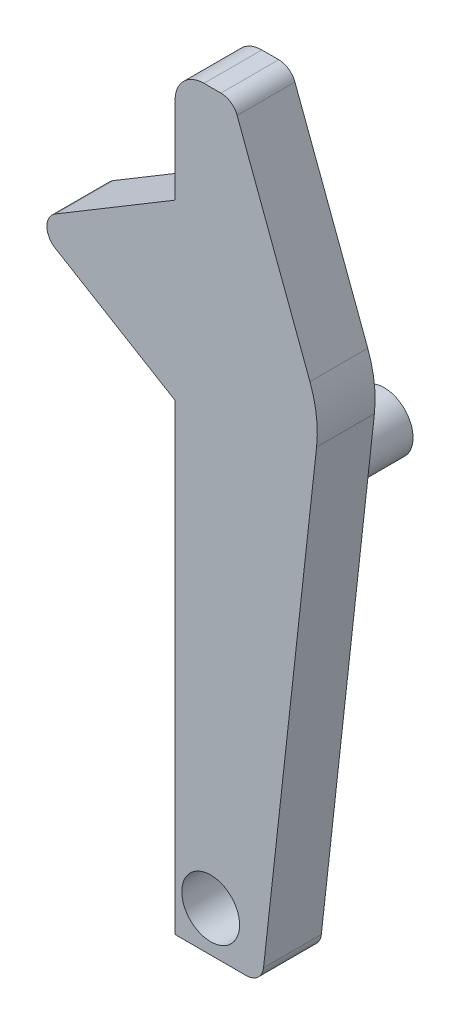
ISO-10303-21;
HEADER;
FILE_DESCRIPTION(('STEP AP214'),'2;1');
FILE_NAME('part.step','',(''),(''),'','','');
FILE_SCHEMA(('AUTOMOTIVE_DESIGN { 1 0 10303 214 1 1 1 1 }'));
ENDSEC;
DATA;
#1=APPLICATION_CONTEXT('core data for automotive mechanical design processes');
#2=APPLICATION_PROTOCOL_DEFINITION('international standard','automotive_design',2000,#1);
#3=PRODUCT_CONTEXT('',#1,'mechanical');
#4=PRODUCT('Part','Part','',(#3));
#5=PRODUCT_RELATED_PRODUCT_CATEGORY('part','',(#4));
#6=PRODUCT_DEFINITION_FORMATION('','',#4);
#7=PRODUCT_DEFINITION_CONTEXT('part definition',#1,'design');
#8=PRODUCT_DEFINITION('design','',#6,#7);
#9=PRODUCT_DEFINITION_SHAPE('','',#8);
#10=(LENGTH_UNIT() NAMED_UNIT(*) SI_UNIT(.MILLI.,.METRE.));
#11=(NAMED_UNIT(*) PLANE_ANGLE_UNIT() SI_UNIT($,.RADIAN.));
#12=(NAMED_UNIT(*) SI_UNIT($,.STERADIAN.) SOLID_ANGLE_UNIT());
#13=UNCERTAINTY_MEASURE_WITH_UNIT(LENGTH_MEASURE(1.E-05),#10,'distance_accuracy_value','');
#14=(GEOMETRIC_REPRESENTATION_CONTEXT(3) GLOBAL_UNCERTAINTY_ASSIGNED_CONTEXT((#13)) GLOBAL_UNIT_ASSIGNED_CONTEXT((#10,
#11,#12)) REPRESENTATION_CONTEXT('',''));
#15=CARTESIAN_POINT('',(0.,0.,0.));
#16=DIRECTION('',(0.,0.,1.));
#17=DIRECTION('',(1.,0.,0.));
#18=AXIS2_PLACEMENT_3D('',#15,#16,#17);
#19=CARTESIAN_POINT('',(-1.18816214355117,0.377227217221665,0.));
#20=DIRECTION('',(0.,0.,1.));
#21=DIRECTION('',(1.,0.,0.));
#22=AXIS2_PLACEMENT_3D('',#19,#20,#21);
#23=PLANE('',#22);
#24=CARTESIAN_POINT('',(0.078162052222077,-4.02277278277832,0.));
#25=DIRECTION('',(0.,0.,-1.));
#26=DIRECTION('',(-1.,0.,0.));
#27=AXIS2_PLACEMENT_3D('',#24,#25,#26);
#28=CIRCLE('',#27,0.25);
#29=CARTESIAN_POINT('',(-0.171837947777923,-4.02277278277832,0.));
#30=VERTEX_POINT('',#29);
#31=EDGE_CURVE('E433',#30,#30,#28,.T.);
#32=ORIENTED_EDGE('',*,*,#31,.F.);
#33=EDGE_LOOP('',(#32));
#34=FACE_BOUND('',#33,.T.);
#35=DIRECTION('',(-0.857492925712546,-0.514495755427526,0.));
#36=VECTOR('',#35,1.);
#37=CARTESIAN_POINT('',(-0.229709738293437,1.12722721722167,0.));
#38=LINE('',#37,#36);
#39=CARTESIAN_POINT('',(-0.229709738293437,1.12722721722167,0.));
#40=VERTEX_POINT('',#39);
#41=CARTESIAN_POINT('',(-1.2653365068653,0.505851156078551,0.));
#42=VERTEX_POINT('',#41);
#43=EDGE_CURVE('E164',#40,#42,#38,.T.);
#44=ORIENTED_EDGE('',*,*,#43,.F.);
#45=DIRECTION('',(0.,-0.999999999999998,0.));
#46=VECTOR('',#45,1.);
#47=CARTESIAN_POINT('',(-0.229709738293435,1.87722721722167,0.));
#48=LINE('',#47,#46);
#49=CARTESIAN_POINT('',(-0.229709738293435,1.87722721722167,0.));
#50=VERTEX_POINT('',#49);
#51=EDGE_CURVE('E103',#50,#40,#48,.T.);
#52=ORIENTED_EDGE('',*,*,#51,.F.);
#53=CARTESIAN_POINT('',(0.0202902617065619,1.87722721722167,0.));
#54=DIRECTION('',(0.,0.,1.));
#55=DIRECTION('',(1.,0.,0.));
#56=AXIS2_PLACEMENT_3D('',#53,#54,#55);
#57=CIRCLE('',#56,0.25);
#58=CARTESIAN_POINT('',(0.0202902617065705,2.12722721722167,0.));
#59=VERTEX_POINT('',#58);
#60=EDGE_CURVE('E97',#59,#50,#57,.T.);
#61=ORIENTED_EDGE('',*,*,#60,.F.);
#62=DIRECTION('',(-1.,0.,0.));
#63=VECTOR('',#62,1.);
#64=CARTESIAN_POINT('',(0.166340191481866,2.12722721722167,0.));
#65=LINE('',#64,#63);
#66=CARTESIAN_POINT('',(0.166340191481866,2.12722721722167,0.));
#67=VERTEX_POINT('',#66);
#68=EDGE_CURVE('E154',#67,#59,#65,.T.);
#69=ORIENTED_EDGE('',*,*,#68,.F.);
#70=CARTESIAN_POINT('',(0.166340191481859,1.97722721722167,0.));
#71=DIRECTION('',(0.,0.,1.));
#72=DIRECTION('',(1.,0.,0.));
#73=AXIS2_PLACEMENT_3D('',#70,#71,#72);
#74=CIRCLE('',#73,0.15);
#75=CARTESIAN_POINT('',(0.306789568117225,2.02989573345993,0.));
#76=VERTEX_POINT('',#75);
#77=EDGE_CURVE('E184',#76,#67,#74,.T.);
#78=ORIENTED_EDGE('',*,*,#77,.F.);
#79=DIRECTION('',(-0.351123441588392,0.936329177569042,0.));
#80=VECTOR('',#79,1.);
#81=CARTESIAN_POINT('',(0.306789568117225,2.02989573345993,0.));
#82=LINE('',#81,#80);
#83=CARTESIAN_POINT('',(0.936329177569032,0.351123441588393,0.));
#84=VERTEX_POINT('',#83);
#85=EDGE_CURVE('E182',#84,#76,#82,.T.);
#86=ORIENTED_EDGE('',*,*,#85,.F.);
#87=CARTESIAN_POINT('',(0.,0.,0.));
#88=DIRECTION('',(0.,0.,1.));
#89=DIRECTION('',(-1.,0.,0.));
#90=AXIS2_PLACEMENT_3D('',#87,#88,#89);
#91=CIRCLE('',#90,1.);
#92=CARTESIAN_POINT('',(0.993883734673618,-0.110431526074843,0.));
#93=VERTEX_POINT('',#92);
#94=EDGE_CURVE('E180',#93,#84,#91,.T.);
#95=ORIENTED_EDGE('',*,*,#94,.F.);
#96=DIRECTION('',(0.110431526074848,0.993883734673617,0.));
#97=VECTOR('',#96,1.);
#98=CARTESIAN_POINT('',(0.993883734673618,-0.110431526074844,0.));
#99=LINE('',#98,#97);
#100=CARTESIAN_POINT('',(0.535116402938657,-4.23933751168954,0.));
#101=VERTEX_POINT('',#100);
#102=EDGE_CURVE('E178',#101,#93,#99,.T.);
#103=ORIENTED_EDGE('',*,*,#102,.F.);
#104=CARTESIAN_POINT('',(0.38603384273761,-4.22277278277832,0.));
#105=DIRECTION('',(0.,0.,1.));
#106=DIRECTION('',(-1.,0.,0.));
#107=AXIS2_PLACEMENT_3D('',#104,#105,#106);
#108=CIRCLE('',#107,0.15);
#109=CARTESIAN_POINT('',(0.386033842737599,-4.37277278277832,0.));
#110=VERTEX_POINT('',#109);
#111=EDGE_CURVE('E176',#110,#101,#108,.T.);
#112=ORIENTED_EDGE('',*,*,#111,.F.);
#113=DIRECTION('',(1.,0.,0.));
#114=VECTOR('',#113,1.);
#115=CARTESIAN_POINT('',(0.386033842737599,-4.37277278277832,0.));
#116=LINE('',#115,#114);
#117=CARTESIAN_POINT('',(-0.229709738293435,-4.37277278277832,0.));
#118=VERTEX_POINT('',#117);
#119=EDGE_CURVE('E174',#118,#110,#116,.T.);
#120=ORIENTED_EDGE('',*,*,#119,.F.);
#121=DIRECTION('',(0.,-0.999999999999998,0.));
#122=VECTOR('',#121,1.);
#123=CARTESIAN_POINT('',(-0.22970973829344,-0.372772782778328,0.));
#124=LINE('',#123,#122);
#125=CARTESIAN_POINT('',(-0.22970973829344,-0.372772782778328,0.));
#126=VERTEX_POINT('',#125);
#127=EDGE_CURVE('E172',#126,#118,#124,.T.);
#128=ORIENTED_EDGE('',*,*,#127,.F.);
#129=DIRECTION('',(0.857492925712545,-0.514495755427524,0.));
#130=VECTOR('',#129,1.);
#131=CARTESIAN_POINT('',(-1.2653365068653,0.248603278364782,0.));
#132=LINE('',#131,#130);
#133=CARTESIAN_POINT('',(-1.2653365068653,0.248603278364782,0.));
#134=VERTEX_POINT('',#133);
#135=EDGE_CURVE('E170',#134,#126,#132,.T.);
#136=ORIENTED_EDGE('',*,*,#135,.F.);
#137=CARTESIAN_POINT('',(-1.18816214355117,0.377227217221665,0.));
#138=DIRECTION('',(0.,0.,1.));
#139=DIRECTION('',(1.,0.,0.));
#140=AXIS2_PLACEMENT_3D('',#137,#138,#139);
#141=CIRCLE('',#140,0.15);
#142=EDGE_CURVE('E167',#42,#134,#141,.T.);
#143=ORIENTED_EDGE('',*,*,#142,.F.);
#144=EDGE_LOOP('',(#44,#52,#61,#69,#78,#86,#95,#103,#112,#120,#128,#136,#143));
#145=FACE_BOUND('',#144,.T.);
#146=CARTESIAN_POINT('',(0.0781620522220909,-1.12277278277833,0.));
#147=DIRECTION('',(0.,0.,1.));
#148=DIRECTION('',(1.,0.,0.));
#149=AXIS2_PLACEMENT_3D('',#146,#147,#148);
#150=CIRCLE('',#149,0.25);
#151=CARTESIAN_POINT('',(0.328162052222091,-1.12277278277832,0.));
#152=VERTEX_POINT('',#151);
#153=EDGE_CURVE('E11',#152,#152,#150,.F.);
#154=ORIENTED_EDGE('',*,*,#153,.F.);
#155=EDGE_LOOP('',(#154));
#156=FACE_BOUND('',#155,.T.);
#157=ADVANCED_FACE('F36',(#34,#145,#156),#23,.F.);
#158=CARTESIAN_POINT('',(-0.229709738293431,1.12722721722167,0.5));
#159=DIRECTION('',(0.514495755427526,-0.857492925712542,0.));
#160=DIRECTION('',(0.857492925712546,0.514495755427526,0.));
#161=AXIS2_PLACEMENT_3D('',#158,#159,#160);
#162=PLANE('',#161);
#163=ORIENTED_EDGE('',*,*,#43,.T.);
#164=DIRECTION('',(0.,0.,-1.));
#165=VECTOR('',#164,1.);
#166=CARTESIAN_POINT('',(-1.2653365068653,0.505851156078548,0.5));
#167=LINE('',#166,#165);
#168=CARTESIAN_POINT('',(-1.2653365068653,0.505851156078548,0.5));
#169=VERTEX_POINT('',#168);
#170=EDGE_CURVE('E45',#169,#42,#167,.T.);
#171=ORIENTED_EDGE('',*,*,#170,.F.);
#172=DIRECTION('',(-0.857492925712546,-0.514495755427526,0.));
#173=VECTOR('',#172,1.);
#174=CARTESIAN_POINT('',(-0.229709738293431,1.12722721722167,0.5));
#175=LINE('',#174,#173);
#176=CARTESIAN_POINT('',(-0.229709738293431,1.12722721722167,0.5));
#177=VERTEX_POINT('',#176);
#178=EDGE_CURVE('E189',#177,#169,#175,.T.);
#179=ORIENTED_EDGE('',*,*,#178,.F.);
#180=DIRECTION('',(0.,0.,-1.));
#181=VECTOR('',#180,1.);
#182=CARTESIAN_POINT('',(-0.229709738293431,1.12722721722167,0.5));
#183=LINE('',#182,#181);
#184=EDGE_CURVE('E160',#177,#40,#183,.T.);
#185=ORIENTED_EDGE('',*,*,#184,.T.);
#186=EDGE_LOOP('',(#163,#171,#179,#185));
#187=FACE_BOUND('',#186,.T.);
#188=ADVANCED_FACE('F38',(#187),#162,.F.);
#189=CARTESIAN_POINT('',(-1.18816214355117,0.377227217221666,0.5));
#190=DIRECTION('',(0.,0.,-1.));
#191=DIRECTION('',(-1.,0.,0.));
#192=AXIS2_PLACEMENT_3D('',#189,#190,#191);
#193=CYLINDRICAL_SURFACE('',#192,0.15);
#194=ORIENTED_EDGE('',*,*,#142,.T.);
#195=DIRECTION('',(0.,0.,-1.));
#196=VECTOR('',#195,1.);
#197=CARTESIAN_POINT('',(-1.2653365068653,0.248603278364787,0.5));
#198=LINE('',#197,#196);
#199=CARTESIAN_POINT('',(-1.2653365068653,0.248603278364787,0.5));
#200=VERTEX_POINT('',#199);
#201=EDGE_CURVE('E214',#200,#134,#198,.T.);
#202=ORIENTED_EDGE('',*,*,#201,.F.);
#203=CARTESIAN_POINT('',(-1.18816214355117,0.377227217221666,0.5));
#204=DIRECTION('',(0.,0.,1.));
#205=DIRECTION('',(1.,0.,0.));
#206=AXIS2_PLACEMENT_3D('',#203,#204,#205);
#207=CIRCLE('',#206,0.15);
#208=EDGE_CURVE('E112',#169,#200,#207,.T.);
#209=ORIENTED_EDGE('',*,*,#208,.F.);
#210=ORIENTED_EDGE('',*,*,#170,.T.);
#211=EDGE_LOOP('',(#194,#202,#209,#210));
#212=FACE_BOUND('',#211,.T.);
#213=ADVANCED_FACE('F217',(#212),#193,.T.);
#214=CARTESIAN_POINT('',(-1.2653365068653,0.248603278364787,0.5));
#215=DIRECTION('',(0.514495755427528,0.857492925712543,0.));
#216=DIRECTION('',(-0.857492925712545,0.514495755427524,0.));
#217=AXIS2_PLACEMENT_3D('',#214,#215,#216);
#218=PLANE('',#217);
#219=ORIENTED_EDGE('',*,*,#135,.T.);
#220=DIRECTION('',(0.,0.,-1.));
#221=VECTOR('',#220,1.);
#222=CARTESIAN_POINT('',(-0.22970973829343,-0.37277278277833,0.500000000000001));
#223=LINE('',#222,#221);
#224=CARTESIAN_POINT('',(-0.22970973829343,-0.37277278277833,0.500000000000001));
#225=VERTEX_POINT('',#224);
#226=EDGE_CURVE('E211',#225,#126,#223,.T.);
#227=ORIENTED_EDGE('',*,*,#226,.F.);
#228=DIRECTION('',(0.857492925712545,-0.514495755427524,0.));
#229=VECTOR('',#228,1.);
#230=CARTESIAN_POINT('',(-1.2653365068653,0.248603278364787,0.5));
#231=LINE('',#230,#229);
#232=EDGE_CURVE('E237',#200,#225,#231,.T.);
#233=ORIENTED_EDGE('',*,*,#232,.F.);
#234=ORIENTED_EDGE('',*,*,#201,.T.);
#235=EDGE_LOOP('',(#219,#227,#233,#234));
#236=FACE_BOUND('',#235,.T.);
#237=ADVANCED_FACE('F228',(#236),#218,.F.);
#238=CARTESIAN_POINT('',(-0.22970973829343,-0.37277278277833,0.500000000000001));
#239=DIRECTION('',(1.,0.,0.));
#240=DIRECTION('',(0.,0.999999999999998,0.));
#241=AXIS2_PLACEMENT_3D('',#238,#239,#240);
#242=PLANE('',#241);
#243=ORIENTED_EDGE('',*,*,#127,.T.);
#244=DIRECTION('',(0.,0.,-1.));
#245=VECTOR('',#244,1.);
#246=CARTESIAN_POINT('',(-0.229709738293433,-4.37277278277832,0.5));
#247=LINE('',#246,#245);
#248=CARTESIAN_POINT('',(-0.229709738293433,-4.37277278277832,0.5));
#249=VERTEX_POINT('',#248);
#250=EDGE_CURVE('E208',#249,#118,#247,.T.);
#251=ORIENTED_EDGE('',*,*,#250,.F.);
#252=DIRECTION('',(0.,-0.999999999999998,0.));
#253=VECTOR('',#252,1.);
#254=CARTESIAN_POINT('',(-0.22970973829343,-0.37277278277833,0.500000000000001));
#255=LINE('',#254,#253);
#256=EDGE_CURVE('E234',#225,#249,#255,.T.);
#257=ORIENTED_EDGE('',*,*,#256,.F.);
#258=ORIENTED_EDGE('',*,*,#226,.T.);
#259=EDGE_LOOP('',(#243,#251,#257,#258));
#260=FACE_BOUND('',#259,.T.);
#261=ADVANCED_FACE('F232',(#260),#242,.F.);
#262=CARTESIAN_POINT('',(0.386033842737596,-4.37277278277832,0.5));
#263=DIRECTION('',(0.,0.999999999999998,0.));
#264=DIRECTION('',(0.,0.,1.));
#265=AXIS2_PLACEMENT_3D('',#262,#263,#264);
#266=PLANE('',#265);
#267=ORIENTED_EDGE('',*,*,#119,.T.);
#268=DIRECTION('',(0.,0.,-1.));
#269=VECTOR('',#268,1.);
#270=CARTESIAN_POINT('',(0.386033842737596,-4.37277278277832,0.5));
#271=LINE('',#270,#269);
#272=CARTESIAN_POINT('',(0.386033842737596,-4.37277278277832,0.5));
#273=VERTEX_POINT('',#272);
#274=EDGE_CURVE('E205',#273,#110,#271,.T.);
#275=ORIENTED_EDGE('',*,*,#274,.F.);
#276=DIRECTION('',(1.,0.,0.));
#277=VECTOR('',#276,1.);
#278=CARTESIAN_POINT('',(0.386033842737596,-4.37277278277832,0.5));
#279=LINE('',#278,#277);
#280=EDGE_CURVE('E236',#249,#273,#279,.T.);
#281=ORIENTED_EDGE('',*,*,#280,.F.);
#282=ORIENTED_EDGE('',*,*,#250,.T.);
#283=EDGE_LOOP('',(#267,#275,#281,#282));
#284=FACE_BOUND('',#283,.T.);
#285=ADVANCED_FACE('F275',(#284),#266,.F.);
#286=CARTESIAN_POINT('',(0.38603384273761,-4.22277278277832,0.5));
#287=DIRECTION('',(0.,0.,-1.));
#288=DIRECTION('',(-1.,0.,0.));
#289=AXIS2_PLACEMENT_3D('',#286,#287,#288);
#290=CYLINDRICAL_SURFACE('',#289,0.15);
#291=ORIENTED_EDGE('',*,*,#111,.T.);
#292=DIRECTION('',(0.,0.,-1.));
#293=VECTOR('',#292,1.);
#294=CARTESIAN_POINT('',(0.535116402938653,-4.23933751168954,0.5));
#295=LINE('',#294,#293);
#296=CARTESIAN_POINT('',(0.535116402938653,-4.23933751168954,0.5));
#297=VERTEX_POINT('',#296);
#298=EDGE_CURVE('E202',#297,#101,#295,.T.);
#299=ORIENTED_EDGE('',*,*,#298,.F.);
#300=CARTESIAN_POINT('',(0.38603384273761,-4.22277278277832,0.5));
#301=DIRECTION('',(0.,0.,1.));
#302=DIRECTION('',(-1.,0.,0.));
#303=AXIS2_PLACEMENT_3D('',#300,#301,#302);
#304=CIRCLE('',#303,0.15);
#305=EDGE_CURVE('E239',#273,#297,#304,.T.);
#306=ORIENTED_EDGE('',*,*,#305,.F.);
#307=ORIENTED_EDGE('',*,*,#274,.T.);
#308=EDGE_LOOP('',(#291,#299,#306,#307));
#309=FACE_BOUND('',#308,.T.);
#310=ADVANCED_FACE('F272',(#309),#290,.T.);
#311=CARTESIAN_POINT('',(0.993883734673618,-0.110431526074845,0.5));
#312=DIRECTION('',(-0.99388373467362,0.110431526074845,0.));
#313=DIRECTION('',(-0.110431526074848,-0.993883734673617,0.));
#314=AXIS2_PLACEMENT_3D('',#311,#312,#313);
#315=PLANE('',#314);
#316=ORIENTED_EDGE('',*,*,#102,.T.);
#317=DIRECTION('',(0.,0.,-1.));
#318=VECTOR('',#317,1.);
#319=CARTESIAN_POINT('',(0.993883734673618,-0.110431526074845,0.5));
#320=LINE('',#319,#318);
#321=CARTESIAN_POINT('',(0.993883734673618,-0.110431526074845,0.5));
#322=VERTEX_POINT('',#321);
#323=EDGE_CURVE('E199',#322,#93,#320,.T.);
#324=ORIENTED_EDGE('',*,*,#323,.F.);
#325=DIRECTION('',(0.110431526074848,0.993883734673617,0.));
#326=VECTOR('',#325,1.);
#327=CARTESIAN_POINT('',(0.993883734673618,-0.110431526074845,0.5));
#328=LINE('',#327,#326);
#329=EDGE_CURVE('E245',#297,#322,#328,.T.);
#330=ORIENTED_EDGE('',*,*,#329,.F.);
#331=ORIENTED_EDGE('',*,*,#298,.T.);
#332=EDGE_LOOP('',(#316,#324,#330,#331));
#333=FACE_BOUND('',#332,.T.);
#334=ADVANCED_FACE('F268',(#333),#315,.F.);
#335=CARTESIAN_POINT('',(0.,0.,0.5));
#336=DIRECTION('',(0.,0.,-1.));
#337=DIRECTION('',(-1.,0.,0.));
#338=AXIS2_PLACEMENT_3D('',#335,#336,#337);
#339=CYLINDRICAL_SURFACE('',#338,1.);
#340=ORIENTED_EDGE('',*,*,#94,.T.);
#341=DIRECTION('',(0.,0.,-1.));
#342=VECTOR('',#341,1.);
#343=CARTESIAN_POINT('',(0.936329177569032,0.351123441588394,0.5));
#344=LINE('',#343,#342);
#345=CARTESIAN_POINT('',(0.936329177569032,0.351123441588394,0.5));
#346=VERTEX_POINT('',#345);
#347=EDGE_CURVE('E196',#346,#84,#344,.T.);
#348=ORIENTED_EDGE('',*,*,#347,.F.);
#349=CARTESIAN_POINT('',(0.,0.,0.5));
#350=DIRECTION('',(0.,0.,1.));
#351=DIRECTION('',(-1.,0.,0.));
#352=AXIS2_PLACEMENT_3D('',#349,#350,#351);
#353=CIRCLE('',#352,1.);
#354=EDGE_CURVE('E247',#322,#346,#353,.T.);
#355=ORIENTED_EDGE('',*,*,#354,.F.);
#356=ORIENTED_EDGE('',*,*,#323,.T.);
#357=EDGE_LOOP('',(#340,#348,#355,#356));
#358=FACE_BOUND('',#357,.T.);
#359=ADVANCED_FACE('F264',(#358),#339,.T.);
#360=CARTESIAN_POINT('',(0.306789568117229,2.02989573345993,0.5));
#361=DIRECTION('',(-0.936329177569046,-0.351123441588393,0.));
#362=DIRECTION('',(0.351123441588392,-0.936329177569042,0.));
#363=AXIS2_PLACEMENT_3D('',#360,#361,#362);
#364=PLANE('',#363);
#365=ORIENTED_EDGE('',*,*,#85,.T.);
#366=DIRECTION('',(0.,0.,-1.));
#367=VECTOR('',#366,1.);
#368=CARTESIAN_POINT('',(0.306789568117229,2.02989573345993,0.5));
#369=LINE('',#368,#367);
#370=CARTESIAN_POINT('',(0.306789568117229,2.02989573345993,0.5));
#371=VERTEX_POINT('',#370);
#372=EDGE_CURVE('E193',#371,#76,#369,.T.);
#373=ORIENTED_EDGE('',*,*,#372,.F.);
#374=DIRECTION('',(-0.351123441588392,0.936329177569042,0.));
#375=VECTOR('',#374,1.);
#376=CARTESIAN_POINT('',(0.306789568117229,2.02989573345993,0.5));
#377=LINE('',#376,#375);
#378=EDGE_CURVE('E249',#346,#371,#377,.T.);
#379=ORIENTED_EDGE('',*,*,#378,.F.);
#380=ORIENTED_EDGE('',*,*,#347,.T.);
#381=EDGE_LOOP('',(#365,#373,#379,#380));
#382=FACE_BOUND('',#381,.T.);
#383=ADVANCED_FACE('F255',(#382),#364,.F.);
#384=CARTESIAN_POINT('',(0.166340191481859,1.97722721722167,0.5));
#385=DIRECTION('',(0.,0.,-1.));
#386=DIRECTION('',(-1.,0.,0.));
#387=AXIS2_PLACEMENT_3D('',#384,#385,#386);
#388=CYLINDRICAL_SURFACE('',#387,0.15);
#389=ORIENTED_EDGE('',*,*,#77,.T.);
#390=DIRECTION('',(0.,0.,-1.));
#391=VECTOR('',#390,1.);
#392=CARTESIAN_POINT('',(0.166340191481859,2.12722721722167,0.500000000000001));
#393=LINE('',#392,#391);
#394=CARTESIAN_POINT('',(0.166340191481859,2.12722721722167,0.500000000000001));
#395=VERTEX_POINT('',#394);
#396=EDGE_CURVE('E155',#395,#67,#393,.T.);
#397=ORIENTED_EDGE('',*,*,#396,.F.);
#398=CARTESIAN_POINT('',(0.166340191481859,1.97722721722167,0.5));
#399=DIRECTION('',(0.,0.,1.));
#400=DIRECTION('',(1.,0.,0.));
#401=AXIS2_PLACEMENT_3D('',#398,#399,#400);
#402=CIRCLE('',#401,0.15);
#403=EDGE_CURVE('E146',#371,#395,#402,.T.);
#404=ORIENTED_EDGE('',*,*,#403,.F.);
#405=ORIENTED_EDGE('',*,*,#372,.T.);
#406=EDGE_LOOP('',(#389,#397,#404,#405));
#407=FACE_BOUND('',#406,.T.);
#408=ADVANCED_FACE('F259',(#407),#388,.T.);
#409=CARTESIAN_POINT('',(0.166340191481859,2.12722721722167,0.500000000000001));
#410=DIRECTION('',(0.,-0.999999999999998,0.));
#411=DIRECTION('',(0.,0.,-1.));
#412=AXIS2_PLACEMENT_3D('',#409,#410,#411);
#413=PLANE('',#412);
#414=ORIENTED_EDGE('',*,*,#68,.T.);
#415=DIRECTION('',(0.,0.,-1.));
#416=VECTOR('',#415,1.);
#417=CARTESIAN_POINT('',(0.0202902617065705,2.12722721722167,0.5));
#418=LINE('',#417,#416);
#419=CARTESIAN_POINT('',(0.0202902617065705,2.12722721722167,0.5));
#420=VERTEX_POINT('',#419);
#421=EDGE_CURVE('E151',#420,#59,#418,.T.);
#422=ORIENTED_EDGE('',*,*,#421,.F.);
#423=DIRECTION('',(-1.,0.,0.));
#424=VECTOR('',#423,1.);
#425=CARTESIAN_POINT('',(0.166340191481859,2.12722721722167,0.500000000000001));
#426=LINE('',#425,#424);
#427=EDGE_CURVE('E140',#395,#420,#426,.T.);
#428=ORIENTED_EDGE('',*,*,#427,.F.);
#429=ORIENTED_EDGE('',*,*,#396,.T.);
#430=EDGE_LOOP('',(#414,#422,#428,#429));
#431=FACE_BOUND('',#430,.T.);
#432=ADVANCED_FACE('F152',(#431),#413,.F.);
#433=CARTESIAN_POINT('',(0.0202902617065653,1.87722721722167,0.5));
#434=DIRECTION('',(0.,0.,-1.));
#435=DIRECTION('',(-1.,0.,0.));
#436=AXIS2_PLACEMENT_3D('',#433,#434,#435);
#437=CYLINDRICAL_SURFACE('',#436,0.25);
#438=ORIENTED_EDGE('',*,*,#60,.T.);
#439=DIRECTION('',(0.,0.,-1.));
#440=VECTOR('',#439,1.);
#441=CARTESIAN_POINT('',(-0.229709738293435,1.87722721722167,0.5));
#442=LINE('',#441,#440);
#443=CARTESIAN_POINT('',(-0.229709738293435,1.87722721722167,0.5));
#444=VERTEX_POINT('',#443);
#445=EDGE_CURVE('E156',#444,#50,#442,.T.);
#446=ORIENTED_EDGE('',*,*,#445,.F.);
#447=CARTESIAN_POINT('',(0.0202902617065653,1.87722721722167,0.5));
#448=DIRECTION('',(0.,0.,1.));
#449=DIRECTION('',(1.,0.,0.));
#450=AXIS2_PLACEMENT_3D('',#447,#448,#449);
#451=CIRCLE('',#450,0.25);
#452=EDGE_CURVE('E144',#420,#444,#451,.T.);
#453=ORIENTED_EDGE('',*,*,#452,.F.);
#454=ORIENTED_EDGE('',*,*,#421,.T.);
#455=EDGE_LOOP('',(#438,#446,#453,#454));
#456=FACE_BOUND('',#455,.T.);
#457=ADVANCED_FACE('F158',(#456),#437,.T.);
#458=CARTESIAN_POINT('',(-0.229709738293435,1.87722721722167,0.5));
#459=DIRECTION('',(1.,0.,0.));
#460=DIRECTION('',(0.,0.999999999999998,0.));
#461=AXIS2_PLACEMENT_3D('',#458,#459,#460);
#462=PLANE('',#461);
#463=ORIENTED_EDGE('',*,*,#51,.T.);
#464=ORIENTED_EDGE('',*,*,#184,.F.);
#465=DIRECTION('',(0.,-0.999999999999998,0.));
#466=VECTOR('',#465,1.);
#467=CARTESIAN_POINT('',(-0.229709738293435,1.87722721722167,0.5));
#468=LINE('',#467,#466);
#469=EDGE_CURVE('E53',#444,#177,#468,.T.);
#470=ORIENTED_EDGE('',*,*,#469,.F.);
#471=ORIENTED_EDGE('',*,*,#445,.T.);
#472=EDGE_LOOP('',(#463,#464,#470,#471));
#473=FACE_BOUND('',#472,.T.);
#474=ADVANCED_FACE('F294',(#473),#462,.F.);
#475=CARTESIAN_POINT('',(-1.18816214355117,0.377227217221666,0.5));
#476=DIRECTION('',(0.,0.,1.));
#477=DIRECTION('',(1.,0.,0.));
#478=AXIS2_PLACEMENT_3D('',#475,#476,#477);
#479=PLANE('',#478);
#480=CARTESIAN_POINT('',(0.078162052222077,-4.02277278277832,0.5));
#481=DIRECTION('',(0.,0.,1.));
#482=DIRECTION('',(1.,0.,0.));
#483=AXIS2_PLACEMENT_3D('',#480,#481,#482);
#484=CIRCLE('',#483,0.25);
#485=CARTESIAN_POINT('',(0.328162052222077,-4.02277278277832,0.5));
#486=VERTEX_POINT('',#485);
#487=EDGE_CURVE('E431',#486,#486,#484,.F.);
#488=ORIENTED_EDGE('',*,*,#487,.T.);
#489=EDGE_LOOP('',(#488));
#490=FACE_BOUND('',#489,.T.);
#491=ORIENTED_EDGE('',*,*,#178,.T.);
#492=ORIENTED_EDGE('',*,*,#208,.T.);
#493=ORIENTED_EDGE('',*,*,#232,.T.);
#494=ORIENTED_EDGE('',*,*,#256,.T.);
#495=ORIENTED_EDGE('',*,*,#280,.T.);
#496=ORIENTED_EDGE('',*,*,#305,.T.);
#497=ORIENTED_EDGE('',*,*,#329,.T.);
#498=ORIENTED_EDGE('',*,*,#354,.T.);
#499=ORIENTED_EDGE('',*,*,#378,.T.);
#500=ORIENTED_EDGE('',*,*,#403,.T.);
#501=ORIENTED_EDGE('',*,*,#427,.T.);
#502=ORIENTED_EDGE('',*,*,#452,.T.);
#503=ORIENTED_EDGE('',*,*,#469,.T.);
#504=EDGE_LOOP('',(#491,#492,#493,#494,#495,#496,#497,#498,#499,#500,#501,#502,#503));
#505=FACE_BOUND('',#504,.T.);
#506=ADVANCED_FACE('F142',(#490,#505),#479,.T.);
#507=CARTESIAN_POINT('',(0.0781620522220944,-1.12277278277832,-1.));
#508=DIRECTION('',(0.,0.,1.));
#509=DIRECTION('',(1.,0.,0.));
#510=AXIS2_PLACEMENT_3D('',#507,#508,#509);
#511=CYLINDRICAL_SURFACE('',#510,0.25);
#512=CARTESIAN_POINT('',(0.0781620522220944,-1.12277278277832,-1.));
#513=DIRECTION('',(0.,0.,-1.));
#514=DIRECTION('',(-1.,0.,0.));
#515=AXIS2_PLACEMENT_3D('',#512,#513,#514);
#516=CIRCLE('',#515,0.25);
#517=CARTESIAN_POINT('',(-0.171837947777906,-1.12277278277833,-1.));
#518=VERTEX_POINT('',#517);
#519=EDGE_CURVE('E168',#518,#518,#516,.T.);
#520=ORIENTED_EDGE('',*,*,#519,.F.);
#521=EDGE_LOOP('',(#520));
#522=FACE_BOUND('',#521,.T.);
#523=ORIENTED_EDGE('',*,*,#153,.T.);
#524=EDGE_LOOP('',(#523));
#525=FACE_BOUND('',#524,.T.);
#526=ADVANCED_FACE('F342',(#522,#525),#511,.T.);
#527=CARTESIAN_POINT('',(0.0781620522220944,-1.12277278277832,-1.));
#528=DIRECTION('',(0.,0.,-1.));
#529=DIRECTION('',(-1.,0.,0.));
#530=AXIS2_PLACEMENT_3D('',#527,#528,#529);
#531=PLANE('',#530);
#532=ORIENTED_EDGE('',*,*,#519,.T.);
#533=EDGE_LOOP('',(#532));
#534=FACE_BOUND('',#533,.T.);
#535=ADVANCED_FACE('F349',(#534),#531,.T.);
#536=CARTESIAN_POINT('',(0.078162052222077,-4.02277278277832,0.501));
#537=DIRECTION('',(0.,0.,-1.));
#538=DIRECTION('',(-1.,0.,0.));
#539=AXIS2_PLACEMENT_3D('',#536,#537,#538);
#540=CYLINDRICAL_SURFACE('',#539,0.25);
#541=ORIENTED_EDGE('',*,*,#487,.F.);
#542=EDGE_LOOP('',(#541));
#543=FACE_BOUND('',#542,.T.);
#544=ORIENTED_EDGE('',*,*,#31,.T.);
#545=EDGE_LOOP('',(#544));
#546=FACE_BOUND('',#545,.T.);
#547=ADVANCED_FACE('F356',(#543,#546),#540,.F.);
#548=CLOSED_SHELL('',(#157,#188,#213,#237,#261,#285,#310,#334,#359,#383,#408,#432,#457,#474,
#506,#526,#535,#547));
#549=MANIFOLD_SOLID_BREP('B2',#548);
#550=ADVANCED_BREP_SHAPE_REPRESENTATION('',(#18,#549),#14);
#551=SHAPE_DEFINITION_REPRESENTATION(#9,#550);
ENDSEC;
END-ISO-10303-21;
